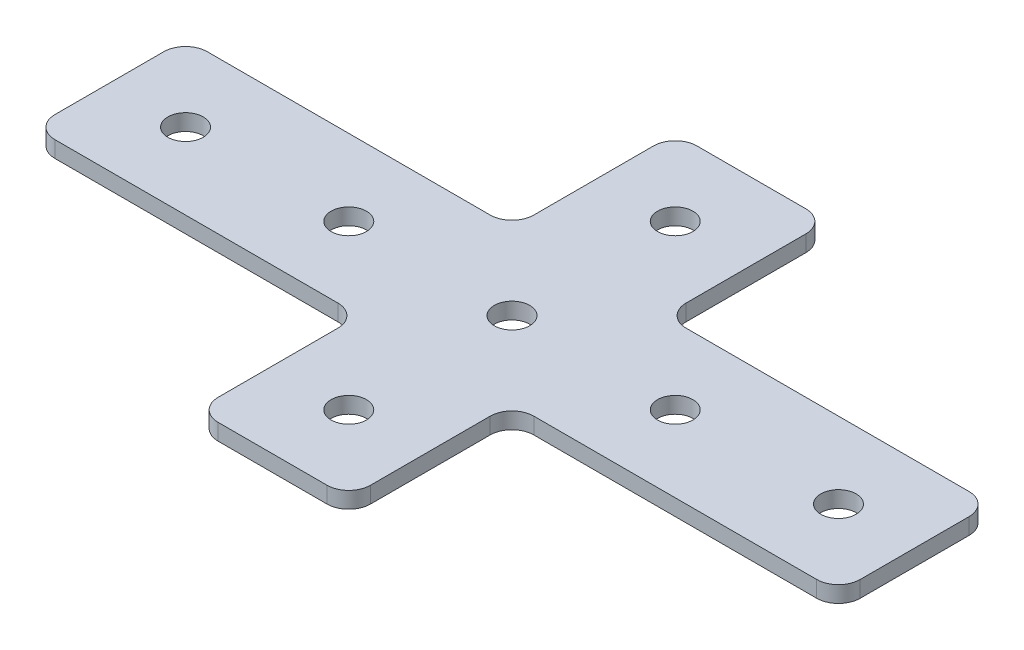
ISO-10303-21;
HEADER;
FILE_DESCRIPTION(('STEP AP214'),'2;1');
FILE_NAME('part.step','',(''),(''),'','','');
FILE_SCHEMA(('AUTOMOTIVE_DESIGN { 1 0 10303 214 1 1 1 1 }'));
ENDSEC;
DATA;
#1=APPLICATION_CONTEXT('core data for automotive mechanical design processes');
#2=APPLICATION_PROTOCOL_DEFINITION('international standard','automotive_design',2000,#1);
#3=PRODUCT_CONTEXT('',#1,'mechanical');
#4=PRODUCT('Part','Part','',(#3));
#5=PRODUCT_RELATED_PRODUCT_CATEGORY('part','',(#4));
#6=PRODUCT_DEFINITION_FORMATION('','',#4);
#7=PRODUCT_DEFINITION_CONTEXT('part definition',#1,'design');
#8=PRODUCT_DEFINITION('design','',#6,#7);
#9=PRODUCT_DEFINITION_SHAPE('','',#8);
#10=(LENGTH_UNIT() NAMED_UNIT(*) SI_UNIT(.MILLI.,.METRE.));
#11=(NAMED_UNIT(*) PLANE_ANGLE_UNIT() SI_UNIT($,.RADIAN.));
#12=(NAMED_UNIT(*) SI_UNIT($,.STERADIAN.) SOLID_ANGLE_UNIT());
#13=UNCERTAINTY_MEASURE_WITH_UNIT(LENGTH_MEASURE(1.E-05),#10,'distance_accuracy_value','');
#14=(GEOMETRIC_REPRESENTATION_CONTEXT(3) GLOBAL_UNCERTAINTY_ASSIGNED_CONTEXT((#13)) GLOBAL_UNIT_ASSIGNED_CONTEXT((#10,
#11,#12)) REPRESENTATION_CONTEXT('',''));
#15=CARTESIAN_POINT('',(0.,0.,0.));
#16=DIRECTION('',(0.,0.,1.));
#17=DIRECTION('',(1.,0.,0.));
#18=AXIS2_PLACEMENT_3D('',#15,#16,#17);
#19=CARTESIAN_POINT('',(-1.74941930794148,2.17462627726309,-1.17473167409798));
#20=DIRECTION('',(0.,-1.,0.));
#21=DIRECTION('',(0.,0.,-1.));
#22=AXIS2_PLACEMENT_3D('',#19,#20,#21);
#23=PLANE('',#22);
#24=CARTESIAN_POINT('',(-16.7494193079415,2.17462627726309,-1.17473167409797));
#25=DIRECTION('',(0.,-1.,0.));
#26=DIRECTION('',(0.,0.,1.));
#27=AXIS2_PLACEMENT_3D('',#24,#25,#26);
#28=CIRCLE('',#27,1.625);
#29=CARTESIAN_POINT('',(-16.7494193079415,2.17462627726309,0.45026832590203));
#30=VERTEX_POINT('',#29);
#31=EDGE_CURVE('E227',#30,#30,#28,.T.);
#32=ORIENTED_EDGE('',*,*,#31,.F.);
#33=EDGE_LOOP('',(#32));
#34=FACE_BOUND('',#33,.T.);
#35=CARTESIAN_POINT('',(-31.7494193079415,2.17462627726309,-1.17473167409797));
#36=DIRECTION('',(0.,-1.,0.));
#37=DIRECTION('',(0.,0.,1.));
#38=AXIS2_PLACEMENT_3D('',#35,#36,#37);
#39=CIRCLE('',#38,1.625);
#40=CARTESIAN_POINT('',(-31.7494193079415,2.17462627726309,0.450268325902037));
#41=VERTEX_POINT('',#40);
#42=EDGE_CURVE('E220',#41,#41,#39,.T.);
#43=ORIENTED_EDGE('',*,*,#42,.F.);
#44=EDGE_LOOP('',(#43));
#45=FACE_BOUND('',#44,.T.);
#46=CARTESIAN_POINT('',(-1.74941930794148,2.17462627726309,-1.17473167409798));
#47=DIRECTION('',(0.,1.,0.));
#48=DIRECTION('',(0.,0.,1.));
#49=AXIS2_PLACEMENT_3D('',#46,#47,#48);
#50=CIRCLE('',#49,1.625);
#51=CARTESIAN_POINT('',(-1.74941930794148,2.17462627726309,0.450268325902016));
#52=VERTEX_POINT('',#51);
#53=EDGE_CURVE('E269',#52,#52,#50,.T.);
#54=ORIENTED_EDGE('',*,*,#53,.T.);
#55=EDGE_LOOP('',(#54));
#56=FACE_BOUND('',#55,.T.);
#57=DIRECTION('',(1.,0.,0.));
#58=VECTOR('',#57,1.);
#59=CARTESIAN_POINT('',(-8.74941930794157,2.17462627726309,-23.1747316740979));
#60=LINE('',#59,#58);
#61=CARTESIAN_POINT('',(-6.74941930794157,2.17462627726309,-23.1747316740979));
#62=VERTEX_POINT('',#61);
#63=CARTESIAN_POINT('',(3.25058069205861,2.17462627726309,-23.1747316740979));
#64=VERTEX_POINT('',#63);
#65=EDGE_CURVE('E461',#62,#64,#60,.T.);
#66=ORIENTED_EDGE('',*,*,#65,.T.);
#67=CARTESIAN_POINT('',(3.25058069205861,2.17462627726309,-21.1747316740979));
#68=DIRECTION('',(0.,-1.,0.));
#69=DIRECTION('',(0.,0.,-1.));
#70=AXIS2_PLACEMENT_3D('',#67,#68,#69);
#71=CIRCLE('',#70,2.);
#72=CARTESIAN_POINT('',(5.25058069205862,2.17462627726309,-21.1747316740979));
#73=VERTEX_POINT('',#72);
#74=EDGE_CURVE('E335',#64,#73,#71,.T.);
#75=ORIENTED_EDGE('',*,*,#74,.T.);
#76=DIRECTION('',(0.,0.,1.));
#77=VECTOR('',#76,1.);
#78=CARTESIAN_POINT('',(5.25058069205862,2.17462627726309,-23.1747316740979));
#79=LINE('',#78,#77);
#80=CARTESIAN_POINT('',(5.25058069205862,2.17462627726309,-10.174731674098));
#81=VERTEX_POINT('',#80);
#82=EDGE_CURVE('E216',#73,#81,#79,.T.);
#83=ORIENTED_EDGE('',*,*,#82,.T.);
#84=CARTESIAN_POINT('',(7.25058069205862,2.17462627726309,-10.174731674098));
#85=DIRECTION('',(0.,-1.,0.));
#86=DIRECTION('',(0.,0.,-1.));
#87=AXIS2_PLACEMENT_3D('',#84,#85,#86);
#88=CIRCLE('',#87,2.);
#89=CARTESIAN_POINT('',(7.25058069205862,2.17462627726309,-8.17473167409802));
#90=VERTEX_POINT('',#89);
#91=EDGE_CURVE('E188',#81,#90,#88,.F.);
#92=ORIENTED_EDGE('',*,*,#91,.T.);
#93=DIRECTION('',(1.,0.,0.));
#94=VECTOR('',#93,1.);
#95=CARTESIAN_POINT('',(5.25058069205862,2.17462627726309,-8.17473167409802));
#96=LINE('',#95,#94);
#97=CARTESIAN_POINT('',(33.2505806920584,2.17462627726309,-8.17473167409802));
#98=VERTEX_POINT('',#97);
#99=EDGE_CURVE('E198',#90,#98,#96,.T.);
#100=ORIENTED_EDGE('',*,*,#99,.T.);
#101=CARTESIAN_POINT('',(33.2505806920584,2.17462627726309,-6.17473167409802));
#102=DIRECTION('',(0.,-1.,0.));
#103=DIRECTION('',(0.,0.,-1.));
#104=AXIS2_PLACEMENT_3D('',#101,#102,#103);
#105=CIRCLE('',#104,2.);
#106=CARTESIAN_POINT('',(35.2505806920584,2.17462627726309,-6.17473167409802));
#107=VERTEX_POINT('',#106);
#108=EDGE_CURVE('E323',#98,#107,#105,.T.);
#109=ORIENTED_EDGE('',*,*,#108,.T.);
#110=DIRECTION('',(0.,0.,-1.));
#111=VECTOR('',#110,1.);
#112=CARTESIAN_POINT('',(35.2505806920584,2.17462627726309,5.82526832590205));
#113=LINE('',#112,#111);
#114=CARTESIAN_POINT('',(35.2505806920584,2.17462627726309,3.82526832590205));
#115=VERTEX_POINT('',#114);
#116=EDGE_CURVE('E278',#115,#107,#113,.T.);
#117=ORIENTED_EDGE('',*,*,#116,.F.);
#118=CARTESIAN_POINT('',(33.2505806920584,2.17462627726309,3.82526832590205));
#119=DIRECTION('',(0.,-1.,0.));
#120=DIRECTION('',(0.,0.,-1.));
#121=AXIS2_PLACEMENT_3D('',#118,#119,#120);
#122=CIRCLE('',#121,2.);
#123=CARTESIAN_POINT('',(33.2505806920584,2.17462627726309,5.82526832590205));
#124=VERTEX_POINT('',#123);
#125=EDGE_CURVE('E325',#115,#124,#122,.T.);
#126=ORIENTED_EDGE('',*,*,#125,.T.);
#127=DIRECTION('',(1.,0.,0.));
#128=VECTOR('',#127,1.);
#129=CARTESIAN_POINT('',(5.25058069205862,2.17462627726309,5.82526832590206));
#130=LINE('',#129,#128);
#131=CARTESIAN_POINT('',(7.25058069205862,2.17462627726309,5.82526832590206));
#132=VERTEX_POINT('',#131);
#133=EDGE_CURVE('E275',#132,#124,#130,.T.);
#134=ORIENTED_EDGE('',*,*,#133,.F.);
#135=CARTESIAN_POINT('',(7.25058069205862,2.17462627726309,7.82526832590206));
#136=DIRECTION('',(0.,-1.,0.));
#137=DIRECTION('',(0.,0.,-1.));
#138=AXIS2_PLACEMENT_3D('',#135,#136,#137);
#139=CIRCLE('',#138,2.);
#140=CARTESIAN_POINT('',(5.25058069205862,2.17462627726309,7.82526832590206));
#141=VERTEX_POINT('',#140);
#142=EDGE_CURVE('E10',#132,#141,#139,.F.);
#143=ORIENTED_EDGE('',*,*,#142,.T.);
#144=DIRECTION('',(0.,0.,-1.));
#145=VECTOR('',#144,1.);
#146=CARTESIAN_POINT('',(5.25058069205862,2.17462627726309,20.825268325902));
#147=LINE('',#146,#145);
#148=CARTESIAN_POINT('',(5.25058069205862,2.17462627726309,18.825268325902));
#149=VERTEX_POINT('',#148);
#150=EDGE_CURVE('E285',#149,#141,#147,.T.);
#151=ORIENTED_EDGE('',*,*,#150,.F.);
#152=CARTESIAN_POINT('',(3.25058069205861,2.17462627726309,18.825268325902));
#153=DIRECTION('',(0.,-1.,0.));
#154=DIRECTION('',(0.,0.,-1.));
#155=AXIS2_PLACEMENT_3D('',#152,#153,#154);
#156=CIRCLE('',#155,2.);
#157=CARTESIAN_POINT('',(3.25058069205861,2.17462627726309,20.825268325902));
#158=VERTEX_POINT('',#157);
#159=EDGE_CURVE('E327',#149,#158,#156,.T.);
#160=ORIENTED_EDGE('',*,*,#159,.T.);
#161=DIRECTION('',(1.,0.,0.));
#162=VECTOR('',#161,1.);
#163=CARTESIAN_POINT('',(-8.74941930794157,2.17462627726309,20.825268325902));
#164=LINE('',#163,#162);
#165=CARTESIAN_POINT('',(-6.74941930794157,2.17462627726309,20.825268325902));
#166=VERTEX_POINT('',#165);
#167=EDGE_CURVE('E282',#166,#158,#164,.T.);
#168=ORIENTED_EDGE('',*,*,#167,.F.);
#169=CARTESIAN_POINT('',(-6.74941930794157,2.17462627726309,18.825268325902));
#170=DIRECTION('',(0.,-1.,0.));
#171=DIRECTION('',(0.,0.,-1.));
#172=AXIS2_PLACEMENT_3D('',#169,#170,#171);
#173=CIRCLE('',#172,2.);
#174=CARTESIAN_POINT('',(-8.74941930794157,2.17462627726309,18.825268325902));
#175=VERTEX_POINT('',#174);
#176=EDGE_CURVE('E329',#166,#175,#173,.T.);
#177=ORIENTED_EDGE('',*,*,#176,.T.);
#178=DIRECTION('',(0.,0.,-1.));
#179=VECTOR('',#178,1.);
#180=CARTESIAN_POINT('',(-8.74941930794157,2.17462627726309,20.825268325902));
#181=LINE('',#180,#179);
#182=CARTESIAN_POINT('',(-8.74941930794157,2.17462627726309,7.82526832590206));
#183=VERTEX_POINT('',#182);
#184=EDGE_CURVE('E240',#175,#183,#181,.T.);
#185=ORIENTED_EDGE('',*,*,#184,.T.);
#186=CARTESIAN_POINT('',(-10.7494193079416,2.17462627726309,7.82526832590206));
#187=DIRECTION('',(0.,-1.,0.));
#188=DIRECTION('',(0.,0.,-1.));
#189=AXIS2_PLACEMENT_3D('',#186,#187,#188);
#190=CIRCLE('',#189,2.);
#191=CARTESIAN_POINT('',(-10.7494193079416,2.17462627726309,5.82526832590206));
#192=VERTEX_POINT('',#191);
#193=EDGE_CURVE('E386',#183,#192,#190,.F.);
#194=ORIENTED_EDGE('',*,*,#193,.T.);
#195=DIRECTION('',(-1.,0.,0.));
#196=VECTOR('',#195,1.);
#197=CARTESIAN_POINT('',(-8.74941930794157,2.17462627726309,5.82526832590206));
#198=LINE('',#197,#196);
#199=CARTESIAN_POINT('',(-36.7494193079414,2.17462627726309,5.82526832590206));
#200=VERTEX_POINT('',#199);
#201=EDGE_CURVE('E233',#192,#200,#198,.T.);
#202=ORIENTED_EDGE('',*,*,#201,.T.);
#203=CARTESIAN_POINT('',(-36.7494193079414,2.17462627726309,3.82526832590206));
#204=DIRECTION('',(0.,-1.,0.));
#205=DIRECTION('',(0.,0.,-1.));
#206=AXIS2_PLACEMENT_3D('',#203,#204,#205);
#207=CIRCLE('',#206,2.);
#208=CARTESIAN_POINT('',(-38.7494193079414,2.17462627726309,3.82526832590206));
#209=VERTEX_POINT('',#208);
#210=EDGE_CURVE('E321',#200,#209,#207,.T.);
#211=ORIENTED_EDGE('',*,*,#210,.T.);
#212=DIRECTION('',(0.,0.,-1.));
#213=VECTOR('',#212,1.);
#214=CARTESIAN_POINT('',(-38.7494193079414,2.17462627726309,5.82526832590206));
#215=LINE('',#214,#213);
#216=CARTESIAN_POINT('',(-38.7494193079414,2.17462627726309,-6.17473167409803));
#217=VERTEX_POINT('',#216);
#218=EDGE_CURVE('E236',#209,#217,#215,.T.);
#219=ORIENTED_EDGE('',*,*,#218,.T.);
#220=CARTESIAN_POINT('',(-36.7494193079414,2.17462627726309,-6.17473167409803));
#221=DIRECTION('',(0.,-1.,0.));
#222=DIRECTION('',(0.,0.,-1.));
#223=AXIS2_PLACEMENT_3D('',#220,#221,#222);
#224=CIRCLE('',#223,2.);
#225=CARTESIAN_POINT('',(-36.7494193079414,2.17462627726309,-8.17473167409803));
#226=VERTEX_POINT('',#225);
#227=EDGE_CURVE('E331',#217,#226,#224,.T.);
#228=ORIENTED_EDGE('',*,*,#227,.T.);
#229=DIRECTION('',(-1.,0.,0.));
#230=VECTOR('',#229,1.);
#231=CARTESIAN_POINT('',(-8.74941930794157,2.17462627726309,-8.17473167409802));
#232=LINE('',#231,#230);
#233=CARTESIAN_POINT('',(-10.7494193079416,2.17462627726309,-8.17473167409802));
#234=VERTEX_POINT('',#233);
#235=EDGE_CURVE('E444',#234,#226,#232,.T.);
#236=ORIENTED_EDGE('',*,*,#235,.F.);
#237=CARTESIAN_POINT('',(-10.7494193079416,2.17462627726309,-10.174731674098));
#238=DIRECTION('',(0.,-1.,0.));
#239=DIRECTION('',(0.,0.,-1.));
#240=AXIS2_PLACEMENT_3D('',#237,#238,#239);
#241=CIRCLE('',#240,2.);
#242=CARTESIAN_POINT('',(-8.74941930794157,2.17462627726309,-10.174731674098));
#243=VERTEX_POINT('',#242);
#244=EDGE_CURVE('E31',#234,#243,#241,.F.);
#245=ORIENTED_EDGE('',*,*,#244,.T.);
#246=DIRECTION('',(0.,0.,1.));
#247=VECTOR('',#246,1.);
#248=CARTESIAN_POINT('',(-8.74941930794157,2.17462627726309,-23.1747316740979));
#249=LINE('',#248,#247);
#250=CARTESIAN_POINT('',(-8.74941930794157,2.17462627726309,-21.1747316740979));
#251=VERTEX_POINT('',#250);
#252=EDGE_CURVE('E450',#251,#243,#249,.T.);
#253=ORIENTED_EDGE('',*,*,#252,.F.);
#254=CARTESIAN_POINT('',(-6.74941930794157,2.17462627726309,-21.1747316740979));
#255=DIRECTION('',(0.,-1.,0.));
#256=DIRECTION('',(0.,0.,-1.));
#257=AXIS2_PLACEMENT_3D('',#254,#255,#256);
#258=CIRCLE('',#257,2.);
#259=EDGE_CURVE('E333',#251,#62,#258,.T.);
#260=ORIENTED_EDGE('',*,*,#259,.T.);
#261=EDGE_LOOP('',(#66,#75,#83,#92,#100,#109,#117,#126,#134,#143,#151,#160,#168,#177,#185,#194,
#202,#211,#219,#228,#236,#245,#253,#260));
#262=FACE_BOUND('',#261,.T.);
#263=CARTESIAN_POINT('',(28.2505806920585,2.17462627726309,-1.17473167409797));
#264=DIRECTION('',(0.,1.,0.));
#265=DIRECTION('',(0.,0.,1.));
#266=AXIS2_PLACEMENT_3D('',#263,#264,#265);
#267=CIRCLE('',#266,1.625);
#268=CARTESIAN_POINT('',(28.2505806920585,2.17462627726309,0.45026832590203));
#269=VERTEX_POINT('',#268);
#270=EDGE_CURVE('E251',#269,#269,#267,.T.);
#271=ORIENTED_EDGE('',*,*,#270,.T.);
#272=EDGE_LOOP('',(#271));
#273=FACE_BOUND('',#272,.T.);
#274=CARTESIAN_POINT('',(-1.74941930794149,2.17462627726309,13.825268325902));
#275=DIRECTION('',(0.,1.,0.));
#276=DIRECTION('',(0.,0.,1.));
#277=AXIS2_PLACEMENT_3D('',#274,#275,#276);
#278=CIRCLE('',#277,1.625);
#279=CARTESIAN_POINT('',(-1.74941930794149,2.17462627726309,15.450268325902));
#280=VERTEX_POINT('',#279);
#281=EDGE_CURVE('E257',#280,#280,#278,.T.);
#282=ORIENTED_EDGE('',*,*,#281,.T.);
#283=EDGE_LOOP('',(#282));
#284=FACE_BOUND('',#283,.T.);
#285=CARTESIAN_POINT('',(13.2505806920585,2.17462627726309,-1.17473167409797));
#286=DIRECTION('',(0.,1.,0.));
#287=DIRECTION('',(0.,0.,1.));
#288=AXIS2_PLACEMENT_3D('',#285,#286,#287);
#289=CIRCLE('',#288,1.625);
#290=CARTESIAN_POINT('',(13.2505806920585,2.17462627726309,0.450268325902027));
#291=VERTEX_POINT('',#290);
#292=EDGE_CURVE('E263',#291,#291,#289,.T.);
#293=ORIENTED_EDGE('',*,*,#292,.T.);
#294=EDGE_LOOP('',(#293));
#295=FACE_BOUND('',#294,.T.);
#296=CARTESIAN_POINT('',(-1.74941930794149,2.17462627726309,-16.174731674098));
#297=DIRECTION('',(0.,-1.,0.));
#298=DIRECTION('',(0.,0.,-1.));
#299=AXIS2_PLACEMENT_3D('',#296,#297,#298);
#300=CIRCLE('',#299,1.625);
#301=CARTESIAN_POINT('',(-1.74941930794149,2.17462627726309,-17.799731674098));
#302=VERTEX_POINT('',#301);
#303=EDGE_CURVE('E207',#302,#302,#300,.T.);
#304=ORIENTED_EDGE('',*,*,#303,.F.);
#305=EDGE_LOOP('',(#304));
#306=FACE_BOUND('',#305,.T.);
#307=ADVANCED_FACE('F16',(#34,#45,#56,#262,#273,#284,#295,#306),#23,.T.);
#308=CARTESIAN_POINT('',(35.2505806920584,2.17462627726309,5.82526832590205));
#309=DIRECTION('',(1.,0.,0.));
#310=DIRECTION('',(0.,0.,-1.));
#311=AXIS2_PLACEMENT_3D('',#308,#309,#310);
#312=PLANE('',#311);
#313=DIRECTION('',(0.,0.,-1.));
#314=VECTOR('',#313,1.);
#315=CARTESIAN_POINT('',(35.2505806920584,3.67462627726309,5.82526832590205));
#316=LINE('',#315,#314);
#317=CARTESIAN_POINT('',(35.2505806920584,3.67462627726309,3.82526832590205));
#318=VERTEX_POINT('',#317);
#319=CARTESIAN_POINT('',(35.2505806920584,3.67462627726309,-6.17473167409802));
#320=VERTEX_POINT('',#319);
#321=EDGE_CURVE('E290',#318,#320,#316,.T.);
#322=ORIENTED_EDGE('',*,*,#321,.F.);
#323=DIRECTION('',(0.,1.,0.));
#324=VECTOR('',#323,1.);
#325=CARTESIAN_POINT('',(35.2505806920584,2.17462627726309,3.82526832590205));
#326=LINE('',#325,#324);
#327=EDGE_CURVE('E189',#318,#115,#326,.F.);
#328=ORIENTED_EDGE('',*,*,#327,.T.);
#329=ORIENTED_EDGE('',*,*,#116,.T.);
#330=DIRECTION('',(0.,1.,0.));
#331=VECTOR('',#330,1.);
#332=CARTESIAN_POINT('',(35.2505806920584,2.17462627726309,-6.17473167409802));
#333=LINE('',#332,#331);
#334=EDGE_CURVE('E376',#107,#320,#333,.T.);
#335=ORIENTED_EDGE('',*,*,#334,.T.);
#336=EDGE_LOOP('',(#322,#328,#329,#335));
#337=FACE_BOUND('',#336,.T.);
#338=ADVANCED_FACE('F493',(#337),#312,.T.);
#339=CARTESIAN_POINT('',(-1.74941930794148,3.67462627726309,-1.17473167409798));
#340=DIRECTION('',(0.,-1.,0.));
#341=DIRECTION('',(0.,0.,-1.));
#342=AXIS2_PLACEMENT_3D('',#339,#340,#341);
#343=PLANE('',#342);
#344=CARTESIAN_POINT('',(-16.7494193079415,3.67462627726309,-1.17473167409797));
#345=DIRECTION('',(0.,-1.,0.));
#346=DIRECTION('',(0.,0.,1.));
#347=AXIS2_PLACEMENT_3D('',#344,#345,#346);
#348=CIRCLE('',#347,1.625);
#349=CARTESIAN_POINT('',(-16.7494193079415,3.67462627726309,0.45026832590203));
#350=VERTEX_POINT('',#349);
#351=EDGE_CURVE('E223',#350,#350,#348,.T.);
#352=ORIENTED_EDGE('',*,*,#351,.T.);
#353=EDGE_LOOP('',(#352));
#354=FACE_BOUND('',#353,.T.);
#355=CARTESIAN_POINT('',(-31.7494193079415,3.67462627726309,-1.17473167409797));
#356=DIRECTION('',(0.,-1.,0.));
#357=DIRECTION('',(0.,0.,1.));
#358=AXIS2_PLACEMENT_3D('',#355,#356,#357);
#359=CIRCLE('',#358,1.625);
#360=CARTESIAN_POINT('',(-31.7494193079415,3.67462627726309,0.450268325902037));
#361=VERTEX_POINT('',#360);
#362=EDGE_CURVE('E224',#361,#361,#359,.T.);
#363=ORIENTED_EDGE('',*,*,#362,.T.);
#364=EDGE_LOOP('',(#363));
#365=FACE_BOUND('',#364,.T.);
#366=CARTESIAN_POINT('',(-1.74941930794148,3.67462627726309,-1.17473167409798));
#367=DIRECTION('',(0.,1.,0.));
#368=DIRECTION('',(0.,0.,1.));
#369=AXIS2_PLACEMENT_3D('',#366,#367,#368);
#370=CIRCLE('',#369,1.625);
#371=CARTESIAN_POINT('',(-1.74941930794148,3.67462627726309,0.450268325902016));
#372=VERTEX_POINT('',#371);
#373=EDGE_CURVE('E266',#372,#372,#370,.T.);
#374=ORIENTED_EDGE('',*,*,#373,.F.);
#375=EDGE_LOOP('',(#374));
#376=FACE_BOUND('',#375,.T.);
#377=DIRECTION('',(0.,0.,1.));
#378=VECTOR('',#377,1.);
#379=CARTESIAN_POINT('',(5.25058069205862,3.67462627726309,-23.1747316740979));
#380=LINE('',#379,#378);
#381=CARTESIAN_POINT('',(5.25058069205862,3.67462627726309,-21.1747316740979));
#382=VERTEX_POINT('',#381);
#383=CARTESIAN_POINT('',(5.25058069205862,3.67462627726309,-10.174731674098));
#384=VERTEX_POINT('',#383);
#385=EDGE_CURVE('E210',#382,#384,#380,.T.);
#386=ORIENTED_EDGE('',*,*,#385,.F.);
#387=CARTESIAN_POINT('',(3.25058069205861,3.67462627726309,-21.1747316740979));
#388=DIRECTION('',(0.,-1.,0.));
#389=DIRECTION('',(0.,0.,-1.));
#390=AXIS2_PLACEMENT_3D('',#387,#388,#389);
#391=CIRCLE('',#390,2.);
#392=CARTESIAN_POINT('',(3.25058069205861,3.67462627726309,-23.1747316740979));
#393=VERTEX_POINT('',#392);
#394=EDGE_CURVE('E314',#382,#393,#391,.F.);
#395=ORIENTED_EDGE('',*,*,#394,.T.);
#396=DIRECTION('',(1.,0.,0.));
#397=VECTOR('',#396,1.);
#398=CARTESIAN_POINT('',(-8.74941930794157,3.67462627726309,-23.1747316740979));
#399=LINE('',#398,#397);
#400=CARTESIAN_POINT('',(-6.74941930794157,3.67462627726309,-23.1747316740979));
#401=VERTEX_POINT('',#400);
#402=EDGE_CURVE('E206',#401,#393,#399,.T.);
#403=ORIENTED_EDGE('',*,*,#402,.F.);
#404=CARTESIAN_POINT('',(-6.74941930794157,3.67462627726309,-21.1747316740979));
#405=DIRECTION('',(0.,-1.,0.));
#406=DIRECTION('',(0.,0.,-1.));
#407=AXIS2_PLACEMENT_3D('',#404,#405,#406);
#408=CIRCLE('',#407,2.);
#409=CARTESIAN_POINT('',(-8.74941930794157,3.67462627726309,-21.1747316740979));
#410=VERTEX_POINT('',#409);
#411=EDGE_CURVE('E312',#401,#410,#408,.F.);
#412=ORIENTED_EDGE('',*,*,#411,.T.);
#413=DIRECTION('',(0.,0.,1.));
#414=VECTOR('',#413,1.);
#415=CARTESIAN_POINT('',(-8.74941930794157,3.67462627726309,-23.1747316740979));
#416=LINE('',#415,#414);
#417=CARTESIAN_POINT('',(-8.74941930794157,3.67462627726309,-10.174731674098));
#418=VERTEX_POINT('',#417);
#419=EDGE_CURVE('E451',#410,#418,#416,.T.);
#420=ORIENTED_EDGE('',*,*,#419,.T.);
#421=CARTESIAN_POINT('',(-10.7494193079416,3.67462627726309,-10.174731674098));
#422=DIRECTION('',(0.,-1.,0.));
#423=DIRECTION('',(0.,0.,-1.));
#424=AXIS2_PLACEMENT_3D('',#421,#422,#423);
#425=CIRCLE('',#424,2.);
#426=CARTESIAN_POINT('',(-10.7494193079416,3.67462627726309,-8.17473167409802));
#427=VERTEX_POINT('',#426);
#428=EDGE_CURVE('E381',#418,#427,#425,.T.);
#429=ORIENTED_EDGE('',*,*,#428,.T.);
#430=DIRECTION('',(-1.,0.,0.));
#431=VECTOR('',#430,1.);
#432=CARTESIAN_POINT('',(-8.74941930794157,3.67462627726309,-8.17473167409802));
#433=LINE('',#432,#431);
#434=CARTESIAN_POINT('',(-36.7494193079414,3.67462627726309,-8.17473167409803));
#435=VERTEX_POINT('',#434);
#436=EDGE_CURVE('E455',#427,#435,#433,.T.);
#437=ORIENTED_EDGE('',*,*,#436,.T.);
#438=CARTESIAN_POINT('',(-36.7494193079414,3.67462627726309,-6.17473167409803));
#439=DIRECTION('',(0.,-1.,0.));
#440=DIRECTION('',(0.,0.,-1.));
#441=AXIS2_PLACEMENT_3D('',#438,#439,#440);
#442=CIRCLE('',#441,2.);
#443=CARTESIAN_POINT('',(-38.7494193079414,3.67462627726309,-6.17473167409803));
#444=VERTEX_POINT('',#443);
#445=EDGE_CURVE('E310',#435,#444,#442,.F.);
#446=ORIENTED_EDGE('',*,*,#445,.T.);
#447=DIRECTION('',(0.,0.,-1.));
#448=VECTOR('',#447,1.);
#449=CARTESIAN_POINT('',(-38.7494193079414,3.67462627726309,5.82526832590206));
#450=LINE('',#449,#448);
#451=CARTESIAN_POINT('',(-38.7494193079414,3.67462627726309,3.82526832590206));
#452=VERTEX_POINT('',#451);
#453=EDGE_CURVE('E246',#452,#444,#450,.T.);
#454=ORIENTED_EDGE('',*,*,#453,.F.);
#455=CARTESIAN_POINT('',(-36.7494193079414,3.67462627726309,3.82526832590206));
#456=DIRECTION('',(0.,-1.,0.));
#457=DIRECTION('',(0.,0.,-1.));
#458=AXIS2_PLACEMENT_3D('',#455,#456,#457);
#459=CIRCLE('',#458,2.);
#460=CARTESIAN_POINT('',(-36.7494193079414,3.67462627726309,5.82526832590206));
#461=VERTEX_POINT('',#460);
#462=EDGE_CURVE('E301',#452,#461,#459,.F.);
#463=ORIENTED_EDGE('',*,*,#462,.T.);
#464=DIRECTION('',(-1.,0.,0.));
#465=VECTOR('',#464,1.);
#466=CARTESIAN_POINT('',(-8.74941930794157,3.67462627726309,5.82526832590206));
#467=LINE('',#466,#465);
#468=CARTESIAN_POINT('',(-10.7494193079416,3.67462627726309,5.82526832590206));
#469=VERTEX_POINT('',#468);
#470=EDGE_CURVE('E230',#469,#461,#467,.T.);
#471=ORIENTED_EDGE('',*,*,#470,.F.);
#472=CARTESIAN_POINT('',(-10.7494193079416,3.67462627726309,7.82526832590206));
#473=DIRECTION('',(0.,-1.,0.));
#474=DIRECTION('',(0.,0.,-1.));
#475=AXIS2_PLACEMENT_3D('',#472,#473,#474);
#476=CIRCLE('',#475,2.);
#477=CARTESIAN_POINT('',(-8.74941930794157,3.67462627726309,7.82526832590206));
#478=VERTEX_POINT('',#477);
#479=EDGE_CURVE('E384',#469,#478,#476,.T.);
#480=ORIENTED_EDGE('',*,*,#479,.T.);
#481=DIRECTION('',(0.,0.,-1.));
#482=VECTOR('',#481,1.);
#483=CARTESIAN_POINT('',(-8.74941930794157,3.67462627726309,20.825268325902));
#484=LINE('',#483,#482);
#485=CARTESIAN_POINT('',(-8.74941930794157,3.67462627726309,18.825268325902));
#486=VERTEX_POINT('',#485);
#487=EDGE_CURVE('E237',#486,#478,#484,.T.);
#488=ORIENTED_EDGE('',*,*,#487,.F.);
#489=CARTESIAN_POINT('',(-6.74941930794157,3.67462627726309,18.825268325902));
#490=DIRECTION('',(0.,-1.,0.));
#491=DIRECTION('',(0.,0.,-1.));
#492=AXIS2_PLACEMENT_3D('',#489,#490,#491);
#493=CIRCLE('',#492,2.);
#494=CARTESIAN_POINT('',(-6.74941930794157,3.67462627726309,20.825268325902));
#495=VERTEX_POINT('',#494);
#496=EDGE_CURVE('E308',#486,#495,#493,.F.);
#497=ORIENTED_EDGE('',*,*,#496,.T.);
#498=DIRECTION('',(1.,0.,0.));
#499=VECTOR('',#498,1.);
#500=CARTESIAN_POINT('',(-8.74941930794157,3.67462627726309,20.825268325902));
#501=LINE('',#500,#499);
#502=CARTESIAN_POINT('',(3.25058069205861,3.67462627726309,20.825268325902));
#503=VERTEX_POINT('',#502);
#504=EDGE_CURVE('E292',#495,#503,#501,.T.);
#505=ORIENTED_EDGE('',*,*,#504,.T.);
#506=CARTESIAN_POINT('',(3.25058069205861,3.67462627726309,18.825268325902));
#507=DIRECTION('',(0.,-1.,0.));
#508=DIRECTION('',(0.,0.,-1.));
#509=AXIS2_PLACEMENT_3D('',#506,#507,#508);
#510=CIRCLE('',#509,2.);
#511=CARTESIAN_POINT('',(5.25058069205862,3.67462627726309,18.825268325902));
#512=VERTEX_POINT('',#511);
#513=EDGE_CURVE('E306',#503,#512,#510,.F.);
#514=ORIENTED_EDGE('',*,*,#513,.T.);
#515=DIRECTION('',(0.,0.,-1.));
#516=VECTOR('',#515,1.);
#517=CARTESIAN_POINT('',(5.25058069205862,3.67462627726309,20.825268325902));
#518=LINE('',#517,#516);
#519=CARTESIAN_POINT('',(5.25058069205862,3.67462627726309,7.82526832590206));
#520=VERTEX_POINT('',#519);
#521=EDGE_CURVE('E279',#512,#520,#518,.T.);
#522=ORIENTED_EDGE('',*,*,#521,.T.);
#523=CARTESIAN_POINT('',(7.25058069205862,3.67462627726309,7.82526832590206));
#524=DIRECTION('',(0.,-1.,0.));
#525=DIRECTION('',(0.,0.,-1.));
#526=AXIS2_PLACEMENT_3D('',#523,#524,#525);
#527=CIRCLE('',#526,2.);
#528=CARTESIAN_POINT('',(7.25058069205862,3.67462627726309,5.82526832590206));
#529=VERTEX_POINT('',#528);
#530=EDGE_CURVE('E24',#520,#529,#527,.T.);
#531=ORIENTED_EDGE('',*,*,#530,.T.);
#532=DIRECTION('',(1.,0.,0.));
#533=VECTOR('',#532,1.);
#534=CARTESIAN_POINT('',(5.25058069205862,3.67462627726309,5.82526832590206));
#535=LINE('',#534,#533);
#536=CARTESIAN_POINT('',(33.2505806920584,3.67462627726309,5.82526832590205));
#537=VERTEX_POINT('',#536);
#538=EDGE_CURVE('E272',#529,#537,#535,.T.);
#539=ORIENTED_EDGE('',*,*,#538,.T.);
#540=CARTESIAN_POINT('',(33.2505806920584,3.67462627726309,3.82526832590205));
#541=DIRECTION('',(0.,-1.,0.));
#542=DIRECTION('',(0.,0.,-1.));
#543=AXIS2_PLACEMENT_3D('',#540,#541,#542);
#544=CIRCLE('',#543,2.);
#545=EDGE_CURVE('E304',#537,#318,#544,.F.);
#546=ORIENTED_EDGE('',*,*,#545,.T.);
#547=ORIENTED_EDGE('',*,*,#321,.T.);
#548=CARTESIAN_POINT('',(33.2505806920584,3.67462627726309,-6.17473167409802));
#549=DIRECTION('',(0.,-1.,0.));
#550=DIRECTION('',(0.,0.,-1.));
#551=AXIS2_PLACEMENT_3D('',#548,#549,#550);
#552=CIRCLE('',#551,2.);
#553=CARTESIAN_POINT('',(33.2505806920584,3.67462627726309,-8.17473167409802));
#554=VERTEX_POINT('',#553);
#555=EDGE_CURVE('E205',#320,#554,#552,.F.);
#556=ORIENTED_EDGE('',*,*,#555,.T.);
#557=DIRECTION('',(1.,0.,0.));
#558=VECTOR('',#557,1.);
#559=CARTESIAN_POINT('',(5.25058069205862,3.67462627726309,-8.17473167409802));
#560=LINE('',#559,#558);
#561=CARTESIAN_POINT('',(7.25058069205862,3.67462627726309,-8.17473167409802));
#562=VERTEX_POINT('',#561);
#563=EDGE_CURVE('E195',#562,#554,#560,.T.);
#564=ORIENTED_EDGE('',*,*,#563,.F.);
#565=CARTESIAN_POINT('',(7.25058069205862,3.67462627726309,-10.174731674098));
#566=DIRECTION('',(0.,-1.,0.));
#567=DIRECTION('',(0.,0.,-1.));
#568=AXIS2_PLACEMENT_3D('',#565,#566,#567);
#569=CIRCLE('',#568,2.);
#570=EDGE_CURVE('E178',#562,#384,#569,.T.);
#571=ORIENTED_EDGE('',*,*,#570,.T.);
#572=EDGE_LOOP('',(#386,#395,#403,#412,#420,#429,#437,#446,#454,#463,#471,#480,#488,#497,#505,
#514,#522,#531,#539,#546,#547,#556,#564,#571));
#573=FACE_BOUND('',#572,.T.);
#574=CARTESIAN_POINT('',(28.2505806920585,3.67462627726309,-1.17473167409797));
#575=DIRECTION('',(0.,1.,0.));
#576=DIRECTION('',(0.,0.,1.));
#577=AXIS2_PLACEMENT_3D('',#574,#575,#576);
#578=CIRCLE('',#577,1.625);
#579=CARTESIAN_POINT('',(28.2505806920585,3.67462627726309,0.45026832590203));
#580=VERTEX_POINT('',#579);
#581=EDGE_CURVE('E243',#580,#580,#578,.T.);
#582=ORIENTED_EDGE('',*,*,#581,.F.);
#583=EDGE_LOOP('',(#582));
#584=FACE_BOUND('',#583,.T.);
#585=CARTESIAN_POINT('',(-1.74941930794149,3.67462627726309,13.825268325902));
#586=DIRECTION('',(0.,1.,0.));
#587=DIRECTION('',(0.,0.,1.));
#588=AXIS2_PLACEMENT_3D('',#585,#586,#587);
#589=CIRCLE('',#588,1.625);
#590=CARTESIAN_POINT('',(-1.74941930794149,3.67462627726309,15.450268325902));
#591=VERTEX_POINT('',#590);
#592=EDGE_CURVE('E254',#591,#591,#589,.T.);
#593=ORIENTED_EDGE('',*,*,#592,.F.);
#594=EDGE_LOOP('',(#593));
#595=FACE_BOUND('',#594,.T.);
#596=CARTESIAN_POINT('',(13.2505806920585,3.67462627726309,-1.17473167409797));
#597=DIRECTION('',(0.,1.,0.));
#598=DIRECTION('',(0.,0.,1.));
#599=AXIS2_PLACEMENT_3D('',#596,#597,#598);
#600=CIRCLE('',#599,1.625);
#601=CARTESIAN_POINT('',(13.2505806920585,3.67462627726309,0.450268325902027));
#602=VERTEX_POINT('',#601);
#603=EDGE_CURVE('E260',#602,#602,#600,.T.);
#604=ORIENTED_EDGE('',*,*,#603,.F.);
#605=EDGE_LOOP('',(#604));
#606=FACE_BOUND('',#605,.T.);
#607=CARTESIAN_POINT('',(-1.74941930794149,3.67462627726309,-16.174731674098));
#608=DIRECTION('',(0.,-1.,0.));
#609=DIRECTION('',(0.,0.,-1.));
#610=AXIS2_PLACEMENT_3D('',#607,#608,#609);
#611=CIRCLE('',#610,1.625);
#612=CARTESIAN_POINT('',(-1.74941930794149,3.67462627726309,-17.799731674098));
#613=VERTEX_POINT('',#612);
#614=EDGE_CURVE('E213',#613,#613,#611,.T.);
#615=ORIENTED_EDGE('',*,*,#614,.T.);
#616=EDGE_LOOP('',(#615));
#617=FACE_BOUND('',#616,.T.);
#618=ADVANCED_FACE('F202',(#354,#365,#376,#573,#584,#595,#606,#617),#343,.F.);
#619=CARTESIAN_POINT('',(-1.74941930794148,2.17462627726309,-1.17473167409798));
#620=DIRECTION('',(0.,1.,0.));
#621=DIRECTION('',(0.,0.,1.));
#622=AXIS2_PLACEMENT_3D('',#619,#620,#621);
#623=CYLINDRICAL_SURFACE('',#622,1.625);
#624=ORIENTED_EDGE('',*,*,#53,.F.);
#625=EDGE_LOOP('',(#624));
#626=FACE_BOUND('',#625,.T.);
#627=ORIENTED_EDGE('',*,*,#373,.T.);
#628=EDGE_LOOP('',(#627));
#629=FACE_BOUND('',#628,.T.);
#630=ADVANCED_FACE('F736',(#626,#629),#623,.F.);
#631=CARTESIAN_POINT('',(13.2505806920585,2.17462627726309,-1.17473167409797));
#632=DIRECTION('',(0.,1.,0.));
#633=DIRECTION('',(0.,0.,1.));
#634=AXIS2_PLACEMENT_3D('',#631,#632,#633);
#635=CYLINDRICAL_SURFACE('',#634,1.625);
#636=ORIENTED_EDGE('',*,*,#603,.T.);
#637=EDGE_LOOP('',(#636));
#638=FACE_BOUND('',#637,.T.);
#639=ORIENTED_EDGE('',*,*,#292,.F.);
#640=EDGE_LOOP('',(#639));
#641=FACE_BOUND('',#640,.T.);
#642=ADVANCED_FACE('F727',(#638,#641),#635,.F.);
#643=CARTESIAN_POINT('',(28.2505806920585,2.17462627726309,-1.17473167409797));
#644=DIRECTION('',(0.,1.,0.));
#645=DIRECTION('',(0.,0.,1.));
#646=AXIS2_PLACEMENT_3D('',#643,#644,#645);
#647=CYLINDRICAL_SURFACE('',#646,1.625);
#648=ORIENTED_EDGE('',*,*,#581,.T.);
#649=EDGE_LOOP('',(#648));
#650=FACE_BOUND('',#649,.T.);
#651=ORIENTED_EDGE('',*,*,#270,.F.);
#652=EDGE_LOOP('',(#651));
#653=FACE_BOUND('',#652,.T.);
#654=ADVANCED_FACE('F719',(#650,#653),#647,.F.);
#655=CARTESIAN_POINT('',(-38.7494193079414,2.17462627726309,5.82526832590206));
#656=DIRECTION('',(-1.,0.,0.));
#657=DIRECTION('',(0.,0.,-1.));
#658=AXIS2_PLACEMENT_3D('',#655,#656,#657);
#659=PLANE('',#658);
#660=ORIENTED_EDGE('',*,*,#453,.T.);
#661=DIRECTION('',(0.,1.,0.));
#662=VECTOR('',#661,1.);
#663=CARTESIAN_POINT('',(-38.7494193079414,2.17462627726309,-6.17473167409803));
#664=LINE('',#663,#662);
#665=EDGE_CURVE('E349',#444,#217,#664,.F.);
#666=ORIENTED_EDGE('',*,*,#665,.T.);
#667=ORIENTED_EDGE('',*,*,#218,.F.);
#668=DIRECTION('',(0.,1.,0.));
#669=VECTOR('',#668,1.);
#670=CARTESIAN_POINT('',(-38.7494193079414,2.17462627726309,3.82526832590206));
#671=LINE('',#670,#669);
#672=EDGE_CURVE('E346',#209,#452,#671,.T.);
#673=ORIENTED_EDGE('',*,*,#672,.T.);
#674=EDGE_LOOP('',(#660,#666,#667,#673));
#675=FACE_BOUND('',#674,.T.);
#676=ADVANCED_FACE('F437',(#675),#659,.T.);
#677=CARTESIAN_POINT('',(-16.7494193079415,2.17462627726309,-1.17473167409797));
#678=DIRECTION('',(0.,1.,0.));
#679=DIRECTION('',(0.,0.,1.));
#680=AXIS2_PLACEMENT_3D('',#677,#678,#679);
#681=CYLINDRICAL_SURFACE('',#680,1.625);
#682=ORIENTED_EDGE('',*,*,#31,.T.);
#683=EDGE_LOOP('',(#682));
#684=FACE_BOUND('',#683,.T.);
#685=ORIENTED_EDGE('',*,*,#351,.F.);
#686=EDGE_LOOP('',(#685));
#687=FACE_BOUND('',#686,.T.);
#688=ADVANCED_FACE('F702',(#684,#687),#681,.F.);
#689=CARTESIAN_POINT('',(-31.7494193079415,2.17462627726309,-1.17473167409797));
#690=DIRECTION('',(0.,1.,0.));
#691=DIRECTION('',(0.,0.,1.));
#692=AXIS2_PLACEMENT_3D('',#689,#690,#691);
#693=CYLINDRICAL_SURFACE('',#692,1.625);
#694=ORIENTED_EDGE('',*,*,#362,.F.);
#695=EDGE_LOOP('',(#694));
#696=FACE_BOUND('',#695,.T.);
#697=ORIENTED_EDGE('',*,*,#42,.T.);
#698=EDGE_LOOP('',(#697));
#699=FACE_BOUND('',#698,.T.);
#700=ADVANCED_FACE('F695',(#696,#699),#693,.F.);
#701=CARTESIAN_POINT('',(5.25058069205862,2.17462627726309,5.82526832590206));
#702=DIRECTION('',(0.,0.,1.));
#703=DIRECTION('',(1.,0.,0.));
#704=AXIS2_PLACEMENT_3D('',#701,#702,#703);
#705=PLANE('',#704);
#706=ORIENTED_EDGE('',*,*,#538,.F.);
#707=DIRECTION('',(0.,1.,0.));
#708=VECTOR('',#707,1.);
#709=CARTESIAN_POINT('',(7.25058069205862,2.17462627726309,5.82526832590206));
#710=LINE('',#709,#708);
#711=EDGE_CURVE('E374',#529,#132,#710,.F.);
#712=ORIENTED_EDGE('',*,*,#711,.T.);
#713=ORIENTED_EDGE('',*,*,#133,.T.);
#714=DIRECTION('',(0.,1.,0.));
#715=VECTOR('',#714,1.);
#716=CARTESIAN_POINT('',(33.2505806920584,2.17462627726309,5.82526832590205));
#717=LINE('',#716,#715);
#718=EDGE_CURVE('E371',#124,#537,#717,.T.);
#719=ORIENTED_EDGE('',*,*,#718,.T.);
#720=EDGE_LOOP('',(#706,#712,#713,#719));
#721=FACE_BOUND('',#720,.T.);
#722=ADVANCED_FACE('F393',(#721),#705,.T.);
#723=CARTESIAN_POINT('',(5.25058069205862,2.17462627726309,20.825268325902));
#724=DIRECTION('',(1.,0.,0.));
#725=DIRECTION('',(0.,0.,-1.));
#726=AXIS2_PLACEMENT_3D('',#723,#724,#725);
#727=PLANE('',#726);
#728=ORIENTED_EDGE('',*,*,#521,.F.);
#729=DIRECTION('',(0.,1.,0.));
#730=VECTOR('',#729,1.);
#731=CARTESIAN_POINT('',(5.25058069205862,2.17462627726309,18.825268325902));
#732=LINE('',#731,#730);
#733=EDGE_CURVE('E369',#512,#149,#732,.F.);
#734=ORIENTED_EDGE('',*,*,#733,.T.);
#735=ORIENTED_EDGE('',*,*,#150,.T.);
#736=DIRECTION('',(0.,1.,0.));
#737=VECTOR('',#736,1.);
#738=CARTESIAN_POINT('',(5.25058069205862,3.67462627726309,7.82526832590206));
#739=LINE('',#738,#737);
#740=EDGE_CURVE('E366',#141,#520,#739,.T.);
#741=ORIENTED_EDGE('',*,*,#740,.T.);
#742=EDGE_LOOP('',(#728,#734,#735,#741));
#743=FACE_BOUND('',#742,.T.);
#744=ADVANCED_FACE('F403',(#743),#727,.T.);
#745=CARTESIAN_POINT('',(-8.74941930794157,2.17462627726309,20.825268325902));
#746=DIRECTION('',(0.,0.,1.));
#747=DIRECTION('',(1.,0.,0.));
#748=AXIS2_PLACEMENT_3D('',#745,#746,#747);
#749=PLANE('',#748);
#750=ORIENTED_EDGE('',*,*,#504,.F.);
#751=DIRECTION('',(0.,1.,0.));
#752=VECTOR('',#751,1.);
#753=CARTESIAN_POINT('',(-6.74941930794157,2.17462627726309,20.825268325902));
#754=LINE('',#753,#752);
#755=EDGE_CURVE('E364',#495,#166,#754,.F.);
#756=ORIENTED_EDGE('',*,*,#755,.T.);
#757=ORIENTED_EDGE('',*,*,#167,.T.);
#758=DIRECTION('',(0.,1.,0.));
#759=VECTOR('',#758,1.);
#760=CARTESIAN_POINT('',(3.25058069205861,2.17462627726309,20.825268325902));
#761=LINE('',#760,#759);
#762=EDGE_CURVE('E361',#158,#503,#761,.T.);
#763=ORIENTED_EDGE('',*,*,#762,.T.);
#764=EDGE_LOOP('',(#750,#756,#757,#763));
#765=FACE_BOUND('',#764,.T.);
#766=ADVANCED_FACE('F412',(#765),#749,.T.);
#767=CARTESIAN_POINT('',(-1.74941930794149,2.17462627726309,13.825268325902));
#768=DIRECTION('',(0.,1.,0.));
#769=DIRECTION('',(0.,0.,1.));
#770=AXIS2_PLACEMENT_3D('',#767,#768,#769);
#771=CYLINDRICAL_SURFACE('',#770,1.625);
#772=ORIENTED_EDGE('',*,*,#592,.T.);
#773=EDGE_LOOP('',(#772));
#774=FACE_BOUND('',#773,.T.);
#775=ORIENTED_EDGE('',*,*,#281,.F.);
#776=EDGE_LOOP('',(#775));
#777=FACE_BOUND('',#776,.T.);
#778=ADVANCED_FACE('F665',(#774,#777),#771,.F.);
#779=CARTESIAN_POINT('',(-8.74941930794157,2.17462627726309,5.82526832590206));
#780=DIRECTION('',(0.,0.,1.));
#781=DIRECTION('',(-1.,0.,0.));
#782=AXIS2_PLACEMENT_3D('',#779,#780,#781);
#783=PLANE('',#782);
#784=ORIENTED_EDGE('',*,*,#201,.F.);
#785=DIRECTION('',(0.,1.,0.));
#786=VECTOR('',#785,1.);
#787=CARTESIAN_POINT('',(-10.7494193079416,3.67462627726309,5.82526832590206));
#788=LINE('',#787,#786);
#789=EDGE_CURVE('E353',#192,#469,#788,.T.);
#790=ORIENTED_EDGE('',*,*,#789,.T.);
#791=ORIENTED_EDGE('',*,*,#470,.T.);
#792=DIRECTION('',(0.,1.,0.));
#793=VECTOR('',#792,1.);
#794=CARTESIAN_POINT('',(-36.7494193079414,2.17462627726309,5.82526832590206));
#795=LINE('',#794,#793);
#796=EDGE_CURVE('E351',#461,#200,#795,.F.);
#797=ORIENTED_EDGE('',*,*,#796,.T.);
#798=EDGE_LOOP('',(#784,#790,#791,#797));
#799=FACE_BOUND('',#798,.T.);
#800=ADVANCED_FACE('F429',(#799),#783,.T.);
#801=CARTESIAN_POINT('',(-8.74941930794157,2.17462627726309,20.825268325902));
#802=DIRECTION('',(-1.,0.,0.));
#803=DIRECTION('',(0.,0.,-1.));
#804=AXIS2_PLACEMENT_3D('',#801,#802,#803);
#805=PLANE('',#804);
#806=ORIENTED_EDGE('',*,*,#487,.T.);
#807=DIRECTION('',(0.,1.,0.));
#808=VECTOR('',#807,1.);
#809=CARTESIAN_POINT('',(-8.74941930794157,2.17462627726309,7.82526832590206));
#810=LINE('',#809,#808);
#811=EDGE_CURVE('E359',#478,#183,#810,.F.);
#812=ORIENTED_EDGE('',*,*,#811,.T.);
#813=ORIENTED_EDGE('',*,*,#184,.F.);
#814=DIRECTION('',(0.,1.,0.));
#815=VECTOR('',#814,1.);
#816=CARTESIAN_POINT('',(-8.74941930794157,2.17462627726309,18.825268325902));
#817=LINE('',#816,#815);
#818=EDGE_CURVE('E356',#175,#486,#817,.T.);
#819=ORIENTED_EDGE('',*,*,#818,.T.);
#820=EDGE_LOOP('',(#806,#812,#813,#819));
#821=FACE_BOUND('',#820,.T.);
#822=ADVANCED_FACE('F420',(#821),#805,.T.);
#823=CARTESIAN_POINT('',(5.25058069205862,2.17462627726309,-8.17473167409802));
#824=DIRECTION('',(0.,0.,-1.));
#825=DIRECTION('',(1.,0.,0.));
#826=AXIS2_PLACEMENT_3D('',#823,#824,#825);
#827=PLANE('',#826);
#828=ORIENTED_EDGE('',*,*,#99,.F.);
#829=DIRECTION('',(0.,1.,0.));
#830=VECTOR('',#829,1.);
#831=CARTESIAN_POINT('',(7.25058069205862,3.67462627726309,-8.17473167409802));
#832=LINE('',#831,#830);
#833=EDGE_CURVE('E182',#90,#562,#832,.T.);
#834=ORIENTED_EDGE('',*,*,#833,.T.);
#835=ORIENTED_EDGE('',*,*,#563,.T.);
#836=DIRECTION('',(0.,1.,0.));
#837=VECTOR('',#836,1.);
#838=CARTESIAN_POINT('',(33.2505806920584,2.17462627726309,-8.17473167409802));
#839=LINE('',#838,#837);
#840=EDGE_CURVE('E200',#554,#98,#839,.F.);
#841=ORIENTED_EDGE('',*,*,#840,.T.);
#842=EDGE_LOOP('',(#828,#834,#835,#841));
#843=FACE_BOUND('',#842,.T.);
#844=ADVANCED_FACE('F194',(#843),#827,.T.);
#845=CARTESIAN_POINT('',(5.25058069205862,2.17462627726309,-23.1747316740979));
#846=DIRECTION('',(1.,0.,0.));
#847=DIRECTION('',(0.,0.,1.));
#848=AXIS2_PLACEMENT_3D('',#845,#846,#847);
#849=PLANE('',#848);
#850=ORIENTED_EDGE('',*,*,#385,.T.);
#851=DIRECTION('',(0.,1.,0.));
#852=VECTOR('',#851,1.);
#853=CARTESIAN_POINT('',(5.25058069205862,2.17462627726309,-10.174731674098));
#854=LINE('',#853,#852);
#855=EDGE_CURVE('E183',#384,#81,#854,.F.);
#856=ORIENTED_EDGE('',*,*,#855,.T.);
#857=ORIENTED_EDGE('',*,*,#82,.F.);
#858=DIRECTION('',(0.,1.,0.));
#859=VECTOR('',#858,1.);
#860=CARTESIAN_POINT('',(5.25058069205862,2.17462627726309,-21.1747316740979));
#861=LINE('',#860,#859);
#862=EDGE_CURVE('E199',#73,#382,#861,.T.);
#863=ORIENTED_EDGE('',*,*,#862,.T.);
#864=EDGE_LOOP('',(#850,#856,#857,#863));
#865=FACE_BOUND('',#864,.T.);
#866=ADVANCED_FACE('F468',(#865),#849,.T.);
#867=CARTESIAN_POINT('',(-8.74941930794157,2.17462627726309,-23.1747316740979));
#868=DIRECTION('',(0.,0.,-1.));
#869=DIRECTION('',(1.,0.,0.));
#870=AXIS2_PLACEMENT_3D('',#867,#868,#869);
#871=PLANE('',#870);
#872=ORIENTED_EDGE('',*,*,#402,.T.);
#873=DIRECTION('',(0.,1.,0.));
#874=VECTOR('',#873,1.);
#875=CARTESIAN_POINT('',(3.25058069205861,2.17462627726309,-23.1747316740979));
#876=LINE('',#875,#874);
#877=EDGE_CURVE('E319',#393,#64,#876,.F.);
#878=ORIENTED_EDGE('',*,*,#877,.T.);
#879=ORIENTED_EDGE('',*,*,#65,.F.);
#880=DIRECTION('',(0.,1.,0.));
#881=VECTOR('',#880,1.);
#882=CARTESIAN_POINT('',(-6.74941930794157,2.17462627726309,-23.1747316740979));
#883=LINE('',#882,#881);
#884=EDGE_CURVE('E316',#62,#401,#883,.T.);
#885=ORIENTED_EDGE('',*,*,#884,.T.);
#886=EDGE_LOOP('',(#872,#878,#879,#885));
#887=FACE_BOUND('',#886,.T.);
#888=ADVANCED_FACE('F474',(#887),#871,.T.);
#889=CARTESIAN_POINT('',(-1.74941930794149,2.17462627726309,-16.174731674098));
#890=DIRECTION('',(0.,1.,0.));
#891=DIRECTION('',(0.,0.,-1.));
#892=AXIS2_PLACEMENT_3D('',#889,#890,#891);
#893=CYLINDRICAL_SURFACE('',#892,1.625);
#894=ORIENTED_EDGE('',*,*,#614,.F.);
#895=EDGE_LOOP('',(#894));
#896=FACE_BOUND('',#895,.T.);
#897=ORIENTED_EDGE('',*,*,#303,.T.);
#898=EDGE_LOOP('',(#897));
#899=FACE_BOUND('',#898,.T.);
#900=ADVANCED_FACE('F621',(#896,#899),#893,.F.);
#901=CARTESIAN_POINT('',(-8.74941930794157,2.17462627726309,-8.17473167409802));
#902=DIRECTION('',(0.,0.,-1.));
#903=DIRECTION('',(-1.,0.,0.));
#904=AXIS2_PLACEMENT_3D('',#901,#902,#903);
#905=PLANE('',#904);
#906=ORIENTED_EDGE('',*,*,#436,.F.);
#907=DIRECTION('',(0.,1.,0.));
#908=VECTOR('',#907,1.);
#909=CARTESIAN_POINT('',(-10.7494193079416,2.17462627726309,-8.17473167409802));
#910=LINE('',#909,#908);
#911=EDGE_CURVE('E344',#427,#234,#910,.F.);
#912=ORIENTED_EDGE('',*,*,#911,.T.);
#913=ORIENTED_EDGE('',*,*,#235,.T.);
#914=DIRECTION('',(0.,1.,0.));
#915=VECTOR('',#914,1.);
#916=CARTESIAN_POINT('',(-36.7494193079414,2.17462627726309,-8.17473167409803));
#917=LINE('',#916,#915);
#918=EDGE_CURVE('E341',#226,#435,#917,.T.);
#919=ORIENTED_EDGE('',*,*,#918,.T.);
#920=EDGE_LOOP('',(#906,#912,#913,#919));
#921=FACE_BOUND('',#920,.T.);
#922=ADVANCED_FACE('F447',(#921),#905,.T.);
#923=CARTESIAN_POINT('',(-8.74941930794157,2.17462627726309,-23.1747316740979));
#924=DIRECTION('',(-1.,0.,0.));
#925=DIRECTION('',(0.,0.,1.));
#926=AXIS2_PLACEMENT_3D('',#923,#924,#925);
#927=PLANE('',#926);
#928=ORIENTED_EDGE('',*,*,#419,.F.);
#929=DIRECTION('',(0.,1.,0.));
#930=VECTOR('',#929,1.);
#931=CARTESIAN_POINT('',(-8.74941930794157,2.17462627726309,-21.1747316740979));
#932=LINE('',#931,#930);
#933=EDGE_CURVE('E38',#410,#251,#932,.F.);
#934=ORIENTED_EDGE('',*,*,#933,.T.);
#935=ORIENTED_EDGE('',*,*,#252,.T.);
#936=DIRECTION('',(0.,1.,0.));
#937=VECTOR('',#936,1.);
#938=CARTESIAN_POINT('',(-8.74941930794157,3.67462627726309,-10.174731674098));
#939=LINE('',#938,#937);
#940=EDGE_CURVE('E337',#243,#418,#939,.T.);
#941=ORIENTED_EDGE('',*,*,#940,.T.);
#942=EDGE_LOOP('',(#928,#934,#935,#941));
#943=FACE_BOUND('',#942,.T.);
#944=ADVANCED_FACE('F479',(#943),#927,.T.);
#945=CARTESIAN_POINT('',(7.25058069205862,2.17462627726309,-10.174731674098));
#946=DIRECTION('',(0.,-1.,0.));
#947=DIRECTION('',(0.,0.,-1.));
#948=AXIS2_PLACEMENT_3D('',#945,#946,#947);
#949=CYLINDRICAL_SURFACE('',#948,2.);
#950=ORIENTED_EDGE('',*,*,#91,.F.);
#951=ORIENTED_EDGE('',*,*,#855,.F.);
#952=ORIENTED_EDGE('',*,*,#570,.F.);
#953=ORIENTED_EDGE('',*,*,#833,.F.);
#954=EDGE_LOOP('',(#950,#951,#952,#953));
#955=FACE_BOUND('',#954,.T.);
#956=ADVANCED_FACE('F181',(#955),#949,.F.);
#957=CARTESIAN_POINT('',(3.25058069205861,2.17462627726309,-21.1747316740979));
#958=DIRECTION('',(0.,1.,0.));
#959=DIRECTION('',(0.,0.,1.));
#960=AXIS2_PLACEMENT_3D('',#957,#958,#959);
#961=CYLINDRICAL_SURFACE('',#960,2.);
#962=ORIENTED_EDGE('',*,*,#74,.F.);
#963=ORIENTED_EDGE('',*,*,#877,.F.);
#964=ORIENTED_EDGE('',*,*,#394,.F.);
#965=ORIENTED_EDGE('',*,*,#862,.F.);
#966=EDGE_LOOP('',(#962,#963,#964,#965));
#967=FACE_BOUND('',#966,.T.);
#968=ADVANCED_FACE('F470',(#967),#961,.T.);
#969=CARTESIAN_POINT('',(-6.74941930794157,2.17462627726309,-21.1747316740979));
#970=DIRECTION('',(0.,1.,0.));
#971=DIRECTION('',(0.,0.,1.));
#972=AXIS2_PLACEMENT_3D('',#969,#970,#971);
#973=CYLINDRICAL_SURFACE('',#972,2.);
#974=ORIENTED_EDGE('',*,*,#259,.F.);
#975=ORIENTED_EDGE('',*,*,#933,.F.);
#976=ORIENTED_EDGE('',*,*,#411,.F.);
#977=ORIENTED_EDGE('',*,*,#884,.F.);
#978=EDGE_LOOP('',(#974,#975,#976,#977));
#979=FACE_BOUND('',#978,.T.);
#980=ADVANCED_FACE('F478',(#979),#973,.T.);
#981=CARTESIAN_POINT('',(-10.7494193079416,2.17462627726309,-10.174731674098));
#982=DIRECTION('',(0.,-1.,0.));
#983=DIRECTION('',(0.,0.,-1.));
#984=AXIS2_PLACEMENT_3D('',#981,#982,#983);
#985=CYLINDRICAL_SURFACE('',#984,2.);
#986=ORIENTED_EDGE('',*,*,#244,.F.);
#987=ORIENTED_EDGE('',*,*,#911,.F.);
#988=ORIENTED_EDGE('',*,*,#428,.F.);
#989=ORIENTED_EDGE('',*,*,#940,.F.);
#990=EDGE_LOOP('',(#986,#987,#988,#989));
#991=FACE_BOUND('',#990,.T.);
#992=ADVANCED_FACE('F482',(#991),#985,.F.);
#993=CARTESIAN_POINT('',(-36.7494193079414,2.17462627726309,-6.17473167409803));
#994=DIRECTION('',(0.,1.,0.));
#995=DIRECTION('',(0.,0.,1.));
#996=AXIS2_PLACEMENT_3D('',#993,#994,#995);
#997=CYLINDRICAL_SURFACE('',#996,2.);
#998=ORIENTED_EDGE('',*,*,#227,.F.);
#999=ORIENTED_EDGE('',*,*,#665,.F.);
#1000=ORIENTED_EDGE('',*,*,#445,.F.);
#1001=ORIENTED_EDGE('',*,*,#918,.F.);
#1002=EDGE_LOOP('',(#998,#999,#1000,#1001));
#1003=FACE_BOUND('',#1002,.T.);
#1004=ADVANCED_FACE('F441',(#1003),#997,.T.);
#1005=CARTESIAN_POINT('',(-10.7494193079416,2.17462627726309,7.82526832590206));
#1006=DIRECTION('',(0.,-1.,0.));
#1007=DIRECTION('',(0.,0.,-1.));
#1008=AXIS2_PLACEMENT_3D('',#1005,#1006,#1007);
#1009=CYLINDRICAL_SURFACE('',#1008,2.);
#1010=ORIENTED_EDGE('',*,*,#193,.F.);
#1011=ORIENTED_EDGE('',*,*,#811,.F.);
#1012=ORIENTED_EDGE('',*,*,#479,.F.);
#1013=ORIENTED_EDGE('',*,*,#789,.F.);
#1014=EDGE_LOOP('',(#1010,#1011,#1012,#1013));
#1015=FACE_BOUND('',#1014,.T.);
#1016=ADVANCED_FACE('F424',(#1015),#1009,.F.);
#1017=CARTESIAN_POINT('',(-6.74941930794157,2.17462627726309,18.825268325902));
#1018=DIRECTION('',(0.,1.,0.));
#1019=DIRECTION('',(0.,0.,1.));
#1020=AXIS2_PLACEMENT_3D('',#1017,#1018,#1019);
#1021=CYLINDRICAL_SURFACE('',#1020,2.);
#1022=ORIENTED_EDGE('',*,*,#176,.F.);
#1023=ORIENTED_EDGE('',*,*,#755,.F.);
#1024=ORIENTED_EDGE('',*,*,#496,.F.);
#1025=ORIENTED_EDGE('',*,*,#818,.F.);
#1026=EDGE_LOOP('',(#1022,#1023,#1024,#1025));
#1027=FACE_BOUND('',#1026,.T.);
#1028=ADVANCED_FACE('F415',(#1027),#1021,.T.);
#1029=CARTESIAN_POINT('',(3.25058069205861,2.17462627726309,18.825268325902));
#1030=DIRECTION('',(0.,1.,0.));
#1031=DIRECTION('',(0.,0.,1.));
#1032=AXIS2_PLACEMENT_3D('',#1029,#1030,#1031);
#1033=CYLINDRICAL_SURFACE('',#1032,2.);
#1034=ORIENTED_EDGE('',*,*,#159,.F.);
#1035=ORIENTED_EDGE('',*,*,#733,.F.);
#1036=ORIENTED_EDGE('',*,*,#513,.F.);
#1037=ORIENTED_EDGE('',*,*,#762,.F.);
#1038=EDGE_LOOP('',(#1034,#1035,#1036,#1037));
#1039=FACE_BOUND('',#1038,.T.);
#1040=ADVANCED_FACE('F406',(#1039),#1033,.T.);
#1041=CARTESIAN_POINT('',(7.25058069205862,2.17462627726309,7.82526832590206));
#1042=DIRECTION('',(0.,-1.,0.));
#1043=DIRECTION('',(0.,0.,-1.));
#1044=AXIS2_PLACEMENT_3D('',#1041,#1042,#1043);
#1045=CYLINDRICAL_SURFACE('',#1044,2.);
#1046=ORIENTED_EDGE('',*,*,#142,.F.);
#1047=ORIENTED_EDGE('',*,*,#711,.F.);
#1048=ORIENTED_EDGE('',*,*,#530,.F.);
#1049=ORIENTED_EDGE('',*,*,#740,.F.);
#1050=EDGE_LOOP('',(#1046,#1047,#1048,#1049));
#1051=FACE_BOUND('',#1050,.T.);
#1052=ADVANCED_FACE('F397',(#1051),#1045,.F.);
#1053=CARTESIAN_POINT('',(33.2505806920584,2.17462627726309,3.82526832590205));
#1054=DIRECTION('',(0.,1.,0.));
#1055=DIRECTION('',(0.,0.,1.));
#1056=AXIS2_PLACEMENT_3D('',#1053,#1054,#1055);
#1057=CYLINDRICAL_SURFACE('',#1056,2.);
#1058=ORIENTED_EDGE('',*,*,#125,.F.);
#1059=ORIENTED_EDGE('',*,*,#327,.F.);
#1060=ORIENTED_EDGE('',*,*,#545,.F.);
#1061=ORIENTED_EDGE('',*,*,#718,.F.);
#1062=EDGE_LOOP('',(#1058,#1059,#1060,#1061));
#1063=FACE_BOUND('',#1062,.T.);
#1064=ADVANCED_FACE('F566',(#1063),#1057,.T.);
#1065=CARTESIAN_POINT('',(33.2505806920584,2.17462627726309,-6.17473167409802));
#1066=DIRECTION('',(0.,1.,0.));
#1067=DIRECTION('',(0.,0.,1.));
#1068=AXIS2_PLACEMENT_3D('',#1065,#1066,#1067);
#1069=CYLINDRICAL_SURFACE('',#1068,2.);
#1070=ORIENTED_EDGE('',*,*,#108,.F.);
#1071=ORIENTED_EDGE('',*,*,#840,.F.);
#1072=ORIENTED_EDGE('',*,*,#555,.F.);
#1073=ORIENTED_EDGE('',*,*,#334,.F.);
#1074=EDGE_LOOP('',(#1070,#1071,#1072,#1073));
#1075=FACE_BOUND('',#1074,.T.);
#1076=ADVANCED_FACE('F575',(#1075),#1069,.T.);
#1077=CARTESIAN_POINT('',(-36.7494193079414,2.17462627726309,3.82526832590206));
#1078=DIRECTION('',(0.,1.,0.));
#1079=DIRECTION('',(0.,0.,1.));
#1080=AXIS2_PLACEMENT_3D('',#1077,#1078,#1079);
#1081=CYLINDRICAL_SURFACE('',#1080,2.);
#1082=ORIENTED_EDGE('',*,*,#210,.F.);
#1083=ORIENTED_EDGE('',*,*,#796,.F.);
#1084=ORIENTED_EDGE('',*,*,#462,.F.);
#1085=ORIENTED_EDGE('',*,*,#672,.F.);
#1086=EDGE_LOOP('',(#1082,#1083,#1084,#1085));
#1087=FACE_BOUND('',#1086,.T.);
#1088=ADVANCED_FACE('F18',(#1087),#1081,.T.);
#1089=CLOSED_SHELL('',(#307,#338,#618,#630,#642,#654,#676,#688,#700,#722,#744,#766,#778,#800,
#822,#844,#866,#888,#900,#922,#944,#956,#968,#980,#992,#1004,#1016,#1028,#1040,#1052,#1064,
#1076,#1088));
#1090=MANIFOLD_SOLID_BREP('B1',#1089);
#1091=ADVANCED_BREP_SHAPE_REPRESENTATION('',(#18,#1090),#14);
#1092=SHAPE_DEFINITION_REPRESENTATION(#9,#1091);
ENDSEC;
END-ISO-10303-21;
